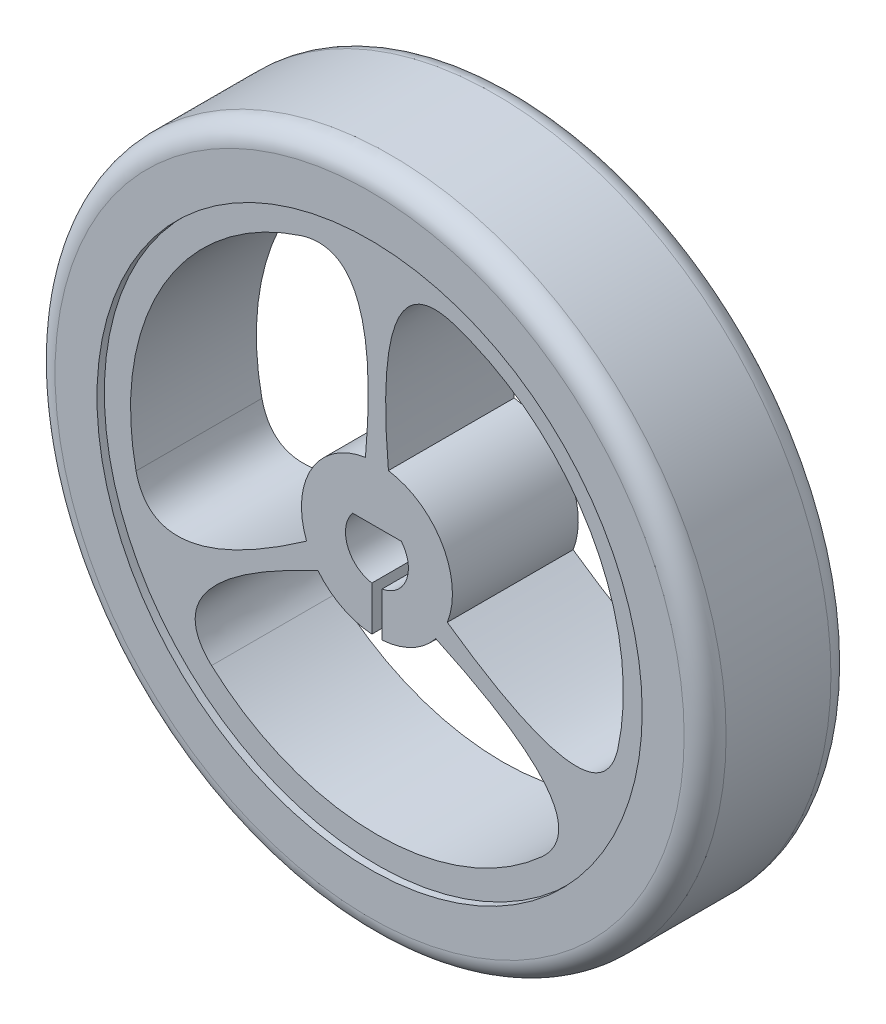
ISO-10303-21;
HEADER;
FILE_DESCRIPTION(('STEP AP214'),'2;1');
FILE_NAME('part.step','',(''),(''),'','','');
FILE_SCHEMA(('AUTOMOTIVE_DESIGN { 1 0 10303 214 1 1 1 1 }'));
ENDSEC;
DATA;
#1=APPLICATION_CONTEXT('core data for automotive mechanical design processes');
#2=APPLICATION_PROTOCOL_DEFINITION('international standard','automotive_design',2000,#1);
#3=PRODUCT_CONTEXT('',#1,'mechanical');
#4=PRODUCT('Part','Part','',(#3));
#5=PRODUCT_RELATED_PRODUCT_CATEGORY('part','',(#4));
#6=PRODUCT_DEFINITION_FORMATION('','',#4);
#7=PRODUCT_DEFINITION_CONTEXT('part definition',#1,'design');
#8=PRODUCT_DEFINITION('design','',#6,#7);
#9=PRODUCT_DEFINITION_SHAPE('','',#8);
#10=(LENGTH_UNIT() NAMED_UNIT(*) SI_UNIT(.MILLI.,.METRE.));
#11=(NAMED_UNIT(*) PLANE_ANGLE_UNIT() SI_UNIT($,.RADIAN.));
#12=(NAMED_UNIT(*) SI_UNIT($,.STERADIAN.) SOLID_ANGLE_UNIT());
#13=UNCERTAINTY_MEASURE_WITH_UNIT(LENGTH_MEASURE(1.E-05),#10,'distance_accuracy_value','');
#14=(GEOMETRIC_REPRESENTATION_CONTEXT(3) GLOBAL_UNCERTAINTY_ASSIGNED_CONTEXT((#13)) GLOBAL_UNIT_ASSIGNED_CONTEXT((#10,
#11,#12)) REPRESENTATION_CONTEXT('',''));
#15=CARTESIAN_POINT('',(0.,0.,0.));
#16=DIRECTION('',(0.,0.,1.));
#17=DIRECTION('',(1.,0.,0.));
#18=AXIS2_PLACEMENT_3D('',#15,#16,#17);
#19=CARTESIAN_POINT('',(0.,0.,4.85));
#20=DIRECTION('',(0.,0.,-1.));
#21=DIRECTION('',(-1.,0.,0.));
#22=AXIS2_PLACEMENT_3D('',#19,#20,#21);
#23=CYLINDRICAL_SURFACE('',#22,13.);
#24=CARTESIAN_POINT('',(0.,0.,-1.5));
#25=DIRECTION('',(0.,0.,-1.));
#26=DIRECTION('',(-1.,0.,0.));
#27=AXIS2_PLACEMENT_3D('',#24,#25,#26);
#28=CIRCLE('',#27,13.);
#29=CARTESIAN_POINT('',(-13.,0.,-1.5));
#30=VERTEX_POINT('',#29);
#31=EDGE_CURVE('E444',#30,#30,#28,.F.);
#32=ORIENTED_EDGE('',*,*,#31,.T.);
#33=EDGE_LOOP('',(#32));
#34=FACE_BOUND('',#33,.T.);
#35=CARTESIAN_POINT('',(0.,0.,-2.15));
#36=DIRECTION('',(0.,0.,1.));
#37=DIRECTION('',(1.,0.,0.));
#38=AXIS2_PLACEMENT_3D('',#35,#36,#37);
#39=CIRCLE('',#38,13.);
#40=CARTESIAN_POINT('',(13.,0.,-2.15));
#41=VERTEX_POINT('',#40);
#42=EDGE_CURVE('E445',#41,#41,#39,.T.);
#43=ORIENTED_EDGE('',*,*,#42,.F.);
#44=EDGE_LOOP('',(#43));
#45=FACE_BOUND('',#44,.T.);
#46=ADVANCED_FACE('F123',(#34,#45),#23,.F.);
#47=CARTESIAN_POINT('',(0.,0.,4.85));
#48=DIRECTION('',(0.,0.,1.));
#49=DIRECTION('',(1.,0.,0.));
#50=AXIS2_PLACEMENT_3D('',#47,#48,#49);
#51=PLANE('',#50);
#52=CARTESIAN_POINT('',(0.,0.,4.85));
#53=DIRECTION('',(0.,0.,1.));
#54=DIRECTION('',(1.,0.,0.));
#55=AXIS2_PLACEMENT_3D('',#52,#53,#54);
#56=CIRCLE('',#55,15.);
#57=CARTESIAN_POINT('',(15.,0.,4.85));
#58=VERTEX_POINT('',#57);
#59=EDGE_CURVE('E529',#58,#58,#56,.T.);
#60=ORIENTED_EDGE('',*,*,#59,.T.);
#61=EDGE_LOOP('',(#60));
#62=FACE_BOUND('',#61,.T.);
#63=CARTESIAN_POINT('',(0.,0.,4.85));
#64=DIRECTION('',(0.,0.,1.));
#65=DIRECTION('',(1.,0.,0.));
#66=AXIS2_PLACEMENT_3D('',#63,#64,#65);
#67=CIRCLE('',#66,13.);
#68=CARTESIAN_POINT('',(13.,0.,4.85));
#69=VERTEX_POINT('',#68);
#70=EDGE_CURVE('E442',#69,#69,#67,.T.);
#71=ORIENTED_EDGE('',*,*,#70,.F.);
#72=EDGE_LOOP('',(#71));
#73=FACE_BOUND('',#72,.T.);
#74=ADVANCED_FACE('F414',(#62,#73),#51,.T.);
#75=CARTESIAN_POINT('',(0.,0.,4.85));
#76=DIRECTION('',(0.,0.,-1.));
#77=DIRECTION('',(-1.,0.,0.));
#78=AXIS2_PLACEMENT_3D('',#75,#76,#77);
#79=CYLINDRICAL_SURFACE('',#78,16.);
#80=CARTESIAN_POINT('',(0.,0.,-1.15));
#81=DIRECTION('',(0.,0.,1.));
#82=DIRECTION('',(1.,0.,0.));
#83=AXIS2_PLACEMENT_3D('',#80,#81,#82);
#84=CIRCLE('',#83,16.);
#85=CARTESIAN_POINT('',(16.,0.,-1.15));
#86=VERTEX_POINT('',#85);
#87=EDGE_CURVE('E131',#86,#86,#84,.T.);
#88=ORIENTED_EDGE('',*,*,#87,.T.);
#89=EDGE_LOOP('',(#88));
#90=FACE_BOUND('',#89,.T.);
#91=CARTESIAN_POINT('',(0.,0.,3.85));
#92=DIRECTION('',(0.,0.,1.));
#93=DIRECTION('',(1.,0.,0.));
#94=AXIS2_PLACEMENT_3D('',#91,#92,#93);
#95=CIRCLE('',#94,16.);
#96=CARTESIAN_POINT('',(16.,0.,3.85));
#97=VERTEX_POINT('',#96);
#98=EDGE_CURVE('E532',#97,#97,#95,.F.);
#99=ORIENTED_EDGE('',*,*,#98,.T.);
#100=EDGE_LOOP('',(#99));
#101=FACE_BOUND('',#100,.T.);
#102=ADVANCED_FACE('F421',(#90,#101),#79,.T.);
#103=CARTESIAN_POINT('',(0.,0.,4.5));
#104=DIRECTION('',(0.,0.,1.));
#105=DIRECTION('',(1.,0.,0.));
#106=AXIS2_PLACEMENT_3D('',#103,#104,#105);
#107=CIRCLE('',#106,13.);
#108=CARTESIAN_POINT('',(13.,0.,4.5));
#109=VERTEX_POINT('',#108);
#110=EDGE_CURVE('E268',#109,#109,#107,.F.);
#111=ORIENTED_EDGE('',*,*,#110,.T.);
#112=EDGE_LOOP('',(#111));
#113=FACE_BOUND('',#112,.T.);
#114=ORIENTED_EDGE('',*,*,#70,.T.);
#115=EDGE_LOOP('',(#114));
#116=FACE_BOUND('',#115,.T.);
#117=ADVANCED_FACE('F417',(#113,#116),#23,.F.);
#118=CARTESIAN_POINT('',(0.,0.,-2.15));
#119=DIRECTION('',(0.,0.,1.));
#120=DIRECTION('',(1.,0.,0.));
#121=AXIS2_PLACEMENT_3D('',#118,#119,#120);
#122=PLANE('',#121);
#123=CARTESIAN_POINT('',(0.,0.,-2.15));
#124=DIRECTION('',(0.,0.,1.));
#125=DIRECTION('',(1.,0.,0.));
#126=AXIS2_PLACEMENT_3D('',#123,#124,#125);
#127=CIRCLE('',#126,15.);
#128=CARTESIAN_POINT('',(15.,0.,-2.15));
#129=VERTEX_POINT('',#128);
#130=EDGE_CURVE('E12',#129,#129,#127,.F.);
#131=ORIENTED_EDGE('',*,*,#130,.T.);
#132=EDGE_LOOP('',(#131));
#133=FACE_BOUND('',#132,.T.);
#134=ORIENTED_EDGE('',*,*,#42,.T.);
#135=EDGE_LOOP('',(#134));
#136=FACE_BOUND('',#135,.T.);
#137=ADVANCED_FACE('F428',(#133,#136),#122,.F.);
#138=CARTESIAN_POINT('',(0.,0.,-2.5));
#139=DIRECTION('',(0.,0.,1.));
#140=DIRECTION('',(1.,0.,0.));
#141=AXIS2_PLACEMENT_3D('',#138,#139,#140);
#142=CYLINDRICAL_SURFACE('',#141,3.6);
#143=DIRECTION('',(0.,0.,1.));
#144=VECTOR('',#143,1.);
#145=CARTESIAN_POINT('',(-0.243283358234703,-3.59177020528959,-2.5));
#146=LINE('',#145,#144);
#147=CARTESIAN_POINT('',(-0.243283358234703,-3.59177020528959,4.5));
#148=VERTEX_POINT('',#147);
#149=CARTESIAN_POINT('',(-0.243283358234703,-3.59177020528959,-1.5));
#150=VERTEX_POINT('',#149);
#151=EDGE_CURVE('E522',#148,#150,#146,.F.);
#152=ORIENTED_EDGE('',*,*,#151,.F.);
#153=CARTESIAN_POINT('',(0.,0.,4.5));
#154=DIRECTION('',(0.,0.,1.));
#155=DIRECTION('',(1.,0.,0.));
#156=AXIS2_PLACEMENT_3D('',#153,#154,#155);
#157=CIRCLE('',#156,3.6);
#158=CARTESIAN_POINT('',(-2.8077726173713,-2.25308964072447,4.5));
#159=VERTEX_POINT('',#158);
#160=EDGE_CURVE('E146',#159,#148,#157,.T.);
#161=ORIENTED_EDGE('',*,*,#160,.F.);
#162=DIRECTION('',(0.,0.,1.));
#163=VECTOR('',#162,1.);
#164=CARTESIAN_POINT('',(-2.8077726173713,-2.25308964072447,-2.5));
#165=LINE('',#164,#163);
#166=CARTESIAN_POINT('',(-2.8077726173713,-2.25308964072447,-1.5));
#167=VERTEX_POINT('',#166);
#168=EDGE_CURVE('E566',#167,#159,#165,.T.);
#169=ORIENTED_EDGE('',*,*,#168,.F.);
#170=CARTESIAN_POINT('',(0.,0.,-1.5));
#171=DIRECTION('',(0.,0.,-1.));
#172=DIRECTION('',(-1.,0.,0.));
#173=AXIS2_PLACEMENT_3D('',#170,#171,#172);
#174=CIRCLE('',#173,3.6);
#175=EDGE_CURVE('E514',#150,#167,#174,.T.);
#176=ORIENTED_EDGE('',*,*,#175,.F.);
#177=EDGE_LOOP('',(#152,#161,#169,#176));
#178=FACE_BOUND('',#177,.T.);
#179=ADVANCED_FACE('F319',(#178),#142,.T.);
#180=CARTESIAN_POINT('',(0.,0.,4.5));
#181=DIRECTION('',(0.,0.,1.));
#182=DIRECTION('',(1.,0.,0.));
#183=AXIS2_PLACEMENT_3D('',#180,#181,#182);
#184=PLANE('',#183);
#185=DIRECTION('',(0.,-1.,0.));
#186=VECTOR('',#185,1.);
#187=CARTESIAN_POINT('',(-0.243283358234703,-3.59177020528959,4.5));
#188=LINE('',#187,#186);
#189=CARTESIAN_POINT('',(-0.243283358234703,-1.48013959058126,4.5));
#190=VERTEX_POINT('',#189);
#191=EDGE_CURVE('E260',#190,#148,#188,.T.);
#192=ORIENTED_EDGE('',*,*,#191,.F.);
#193=CARTESIAN_POINT('',(0.,0.,4.5));
#194=DIRECTION('',(0.,0.,1.));
#195=DIRECTION('',(1.,0.,0.));
#196=AXIS2_PLACEMENT_3D('',#193,#194,#195);
#197=CIRCLE('',#196,1.5);
#198=CARTESIAN_POINT('',(-1.16213688269537,0.948386981078451,4.5));
#199=VERTEX_POINT('',#198);
#200=EDGE_CURVE('E277',#199,#190,#197,.T.);
#201=ORIENTED_EDGE('',*,*,#200,.F.);
#202=DIRECTION('',(-1.,0.,0.));
#203=VECTOR('',#202,1.);
#204=CARTESIAN_POINT('',(-1.16213688269537,0.94838698107845,4.5));
#205=LINE('',#204,#203);
#206=CARTESIAN_POINT('',(1.16213688269537,0.94838698107845,4.5));
#207=VERTEX_POINT('',#206);
#208=EDGE_CURVE('E275',#207,#199,#205,.T.);
#209=ORIENTED_EDGE('',*,*,#208,.F.);
#210=CARTESIAN_POINT('',(0.,0.,4.5));
#211=DIRECTION('',(0.,0.,1.));
#212=DIRECTION('',(1.,0.,0.));
#213=AXIS2_PLACEMENT_3D('',#210,#211,#212);
#214=CIRCLE('',#213,1.5);
#215=CARTESIAN_POINT('',(0.246794300601734,-1.47955823582261,4.5));
#216=VERTEX_POINT('',#215);
#217=EDGE_CURVE('E255',#216,#207,#214,.T.);
#218=ORIENTED_EDGE('',*,*,#217,.F.);
#219=DIRECTION('',(0.,1.,0.));
#220=VECTOR('',#219,1.);
#221=CARTESIAN_POINT('',(0.246794300601735,-1.47955823582261,4.5));
#222=LINE('',#221,#220);
#223=CARTESIAN_POINT('',(0.246794300601735,-3.59153067273419,4.5));
#224=VERTEX_POINT('',#223);
#225=EDGE_CURVE('E263',#224,#216,#222,.T.);
#226=ORIENTED_EDGE('',*,*,#225,.F.);
#227=CARTESIAN_POINT('',(2.80777261737127,-2.25308964072451,4.5));
#228=VERTEX_POINT('',#227);
#229=EDGE_CURVE('E292',#224,#228,#157,.T.);
#230=ORIENTED_EDGE('',*,*,#229,.T.);
#231=CARTESIAN_POINT('',(2.80777261737127,-2.25308964072451,4.5));
#232=CARTESIAN_POINT('',(11.0278157301892,-6.07186206717597,4.5));
#233=CARTESIAN_POINT('',(7.7169011218461,-8.8606961958782,4.5));
#234=B_SPLINE_CURVE_WITH_KNOTS('',2,(#231,#232,#233),.UNSPECIFIED.,.F.,.F.,(3,3),(0.,1.),.UNSPECIFIED.);
#235=CARTESIAN_POINT('',(7.88642735997128,-8.71015289738915,4.5));
#236=VERTEX_POINT('',#235);
#237=EDGE_CURVE('E556',#228,#236,#234,.T.);
#238=ORIENTED_EDGE('',*,*,#237,.T.);
#239=CARTESIAN_POINT('',(0.,0.,4.5));
#240=DIRECTION('',(0.,0.,1.));
#241=DIRECTION('',(1.,0.,0.));
#242=AXIS2_PLACEMENT_3D('',#239,#240,#241);
#243=CIRCLE('',#242,11.75);
#244=CARTESIAN_POINT('',(-7.88642735997125,-8.71015289738917,4.5));
#245=VERTEX_POINT('',#244);
#246=EDGE_CURVE('E569',#245,#236,#243,.T.);
#247=ORIENTED_EDGE('',*,*,#246,.F.);
#248=CARTESIAN_POINT('',(-2.8077726173713,-2.25308964072447,4.5));
#249=CARTESIAN_POINT('',(-11.0278157301894,-6.07186206717588,4.5));
#250=CARTESIAN_POINT('',(-7.71690112184623,-8.86069619587809,4.5));
#251=B_SPLINE_CURVE_WITH_KNOTS('',2,(#248,#249,#250),.UNSPECIFIED.,.F.,.F.,(3,3),(0.,1.),.UNSPECIFIED.);
#252=EDGE_CURVE('E572',#159,#245,#251,.T.);
#253=ORIENTED_EDGE('',*,*,#252,.F.);
#254=ORIENTED_EDGE('',*,*,#160,.T.);
#255=EDGE_LOOP('',(#192,#201,#209,#218,#226,#230,#238,#247,#253,#254));
#256=FACE_BOUND('',#255,.T.);
#257=CARTESIAN_POINT('',(3.35511917455654,-1.30505759433179,4.5));
#258=CARTESIAN_POINT('',(10.7722946635441,-6.51443753700967,4.5));
#259=CARTESIAN_POINT('',(11.5320385617697,-2.25268431207237,4.5));
#260=B_SPLINE_CURVE_WITH_KNOTS('',2,(#257,#258,#259),.UNSPECIFIED.,.F.,.F.,(3,3),(0.,1.),.UNSPECIFIED.);
#261=CARTESIAN_POINT('',(3.35511917455654,-1.30505759433179,4.5));
#262=VERTEX_POINT('',#261);
#263=CARTESIAN_POINT('',(11.4864273599712,-2.47476999014158,4.5));
#264=VERTEX_POINT('',#263);
#265=EDGE_CURVE('E343',#262,#264,#260,.T.);
#266=ORIENTED_EDGE('',*,*,#265,.F.);
#267=CARTESIAN_POINT('',(0.,0.,4.5));
#268=DIRECTION('',(0.,0.,1.));
#269=DIRECTION('',(1.,0.,0.));
#270=AXIS2_PLACEMENT_3D('',#267,#268,#269);
#271=CIRCLE('',#270,3.6);
#272=CARTESIAN_POINT('',(0.547346557185329,3.5581472350561,4.5));
#273=VERTEX_POINT('',#272);
#274=EDGE_CURVE('E337',#262,#273,#271,.T.);
#275=ORIENTED_EDGE('',*,*,#274,.T.);
#276=CARTESIAN_POINT('',(0.547346557185512,3.55814723505607,4.5));
#277=CARTESIAN_POINT('',(-0.255521066645149,12.5862996041855,4.5));
#278=CARTESIAN_POINT('',(3.81513743992355,11.1133805079505,4.5));
#279=B_SPLINE_CURVE_WITH_KNOTS('',2,(#276,#277,#278),.UNSPECIFIED.,.F.,.F.,(3,3),(0.,1.),.UNSPECIFIED.);
#280=CARTESIAN_POINT('',(3.60000000000039,11.1849228875302,4.5));
#281=VERTEX_POINT('',#280);
#282=EDGE_CURVE('E355',#273,#281,#279,.T.);
#283=ORIENTED_EDGE('',*,*,#282,.T.);
#284=CARTESIAN_POINT('',(0.,0.,4.5));
#285=DIRECTION('',(0.,0.,1.));
#286=DIRECTION('',(1.,0.,0.));
#287=AXIS2_PLACEMENT_3D('',#284,#285,#286);
#288=CIRCLE('',#287,11.75);
#289=EDGE_CURVE('E349',#264,#281,#288,.T.);
#290=ORIENTED_EDGE('',*,*,#289,.F.);
#291=EDGE_LOOP('',(#266,#275,#283,#290));
#292=FACE_BOUND('',#291,.T.);
#293=ORIENTED_EDGE('',*,*,#110,.F.);
#294=EDGE_LOOP('',(#293));
#295=FACE_BOUND('',#294,.T.);
#296=CARTESIAN_POINT('',(-0.547346557185464,3.55814723505608,4.5));
#297=CARTESIAN_POINT('',(0.255521066645336,12.5862996041855,4.5));
#298=CARTESIAN_POINT('',(-3.8151374399234,11.1133805079505,4.5));
#299=B_SPLINE_CURVE_WITH_KNOTS('',2,(#296,#297,#298),.UNSPECIFIED.,.F.,.F.,(3,3),(0.,1.),.UNSPECIFIED.);
#300=CARTESIAN_POINT('',(-0.547346557185464,3.55814723505608,4.5));
#301=VERTEX_POINT('',#300);
#302=CARTESIAN_POINT('',(-3.60000000000043,11.1849228875302,4.5));
#303=VERTEX_POINT('',#302);
#304=EDGE_CURVE('E829',#301,#303,#299,.T.);
#305=ORIENTED_EDGE('',*,*,#304,.F.);
#306=CARTESIAN_POINT('',(0.,0.,4.5));
#307=DIRECTION('',(0.,0.,1.));
#308=DIRECTION('',(1.,0.,0.));
#309=AXIS2_PLACEMENT_3D('',#306,#307,#308);
#310=CIRCLE('',#309,3.6);
#311=CARTESIAN_POINT('',(-3.35511917455662,-1.30505759433157,4.5));
#312=VERTEX_POINT('',#311);
#313=EDGE_CURVE('E366',#301,#312,#310,.T.);
#314=ORIENTED_EDGE('',*,*,#313,.T.);
#315=CARTESIAN_POINT('',(-3.35511917455655,-1.30505759433174,4.5));
#316=CARTESIAN_POINT('',(-10.7722946635441,-6.51443753700951,4.5));
#317=CARTESIAN_POINT('',(-11.5320385617697,-2.25268431207221,4.5));
#318=B_SPLINE_CURVE_WITH_KNOTS('',2,(#315,#316,#317),.UNSPECIFIED.,.F.,.F.,(3,3),(0.,1.),.UNSPECIFIED.);
#319=CARTESIAN_POINT('',(-11.4864273599712,-2.47476999014161,4.5));
#320=VERTEX_POINT('',#319);
#321=EDGE_CURVE('E835',#312,#320,#318,.T.);
#322=ORIENTED_EDGE('',*,*,#321,.T.);
#323=CARTESIAN_POINT('',(0.,0.,4.5));
#324=DIRECTION('',(0.,0.,1.));
#325=DIRECTION('',(1.,0.,0.));
#326=AXIS2_PLACEMENT_3D('',#323,#324,#325);
#327=CIRCLE('',#326,11.75);
#328=EDGE_CURVE('E832',#303,#320,#327,.T.);
#329=ORIENTED_EDGE('',*,*,#328,.F.);
#330=EDGE_LOOP('',(#305,#314,#322,#329));
#331=FACE_BOUND('',#330,.T.);
#332=ADVANCED_FACE('F271',(#256,#292,#295,#331),#184,.T.);
#333=CARTESIAN_POINT('',(0.,0.,-1.5));
#334=DIRECTION('',(0.,0.,-1.));
#335=DIRECTION('',(-1.,0.,0.));
#336=AXIS2_PLACEMENT_3D('',#333,#334,#335);
#337=PLANE('',#336);
#338=DIRECTION('',(0.,1.,0.));
#339=VECTOR('',#338,1.);
#340=CARTESIAN_POINT('',(-0.243283358234703,0.,-1.5));
#341=LINE('',#340,#339);
#342=CARTESIAN_POINT('',(-0.243283358234703,-1.48013959058126,-1.5));
#343=VERTEX_POINT('',#342);
#344=EDGE_CURVE('E290',#150,#343,#341,.T.);
#345=ORIENTED_EDGE('',*,*,#344,.F.);
#346=ORIENTED_EDGE('',*,*,#175,.T.);
#347=CARTESIAN_POINT('',(-2.8077726173713,-2.25308964072447,-1.5));
#348=CARTESIAN_POINT('',(-11.0278157301894,-6.07186206717588,-1.5));
#349=CARTESIAN_POINT('',(-7.71690112184623,-8.86069619587809,-1.5));
#350=B_SPLINE_CURVE_WITH_KNOTS('',2,(#347,#348,#349),.UNSPECIFIED.,.F.,.F.,(3,3),(0.,1.),.UNSPECIFIED.);
#351=CARTESIAN_POINT('',(-7.88642735997125,-8.71015289738917,-1.5));
#352=VERTEX_POINT('',#351);
#353=EDGE_CURVE('E498',#352,#167,#350,.F.);
#354=ORIENTED_EDGE('',*,*,#353,.F.);
#355=CARTESIAN_POINT('',(0.,0.,-1.5));
#356=DIRECTION('',(0.,0.,-1.));
#357=DIRECTION('',(-1.,0.,0.));
#358=AXIS2_PLACEMENT_3D('',#355,#356,#357);
#359=CIRCLE('',#358,11.75);
#360=CARTESIAN_POINT('',(7.88642735997128,-8.71015289738915,-1.5));
#361=VERTEX_POINT('',#360);
#362=EDGE_CURVE('E503',#361,#352,#359,.T.);
#363=ORIENTED_EDGE('',*,*,#362,.F.);
#364=CARTESIAN_POINT('',(2.80777261737127,-2.25308964072451,-1.5));
#365=CARTESIAN_POINT('',(11.0278157301892,-6.07186206717597,-1.5));
#366=CARTESIAN_POINT('',(7.7169011218461,-8.8606961958782,-1.5));
#367=B_SPLINE_CURVE_WITH_KNOTS('',2,(#364,#365,#366),.UNSPECIFIED.,.F.,.F.,(3,3),(0.,1.),.UNSPECIFIED.);
#368=CARTESIAN_POINT('',(2.80777261737127,-2.25308964072451,-1.5));
#369=VERTEX_POINT('',#368);
#370=EDGE_CURVE('E509',#361,#369,#367,.F.);
#371=ORIENTED_EDGE('',*,*,#370,.T.);
#372=CARTESIAN_POINT('',(0.246794300601735,-3.59153067273419,-1.5));
#373=VERTEX_POINT('',#372);
#374=EDGE_CURVE('E515',#369,#373,#174,.T.);
#375=ORIENTED_EDGE('',*,*,#374,.T.);
#376=DIRECTION('',(0.,-1.,0.));
#377=VECTOR('',#376,1.);
#378=CARTESIAN_POINT('',(0.246794300601735,0.,-1.5));
#379=LINE('',#378,#377);
#380=CARTESIAN_POINT('',(0.246794300601734,-1.47955823582261,-1.5));
#381=VERTEX_POINT('',#380);
#382=EDGE_CURVE('E138',#381,#373,#379,.T.);
#383=ORIENTED_EDGE('',*,*,#382,.F.);
#384=CARTESIAN_POINT('',(0.,0.,-1.5));
#385=DIRECTION('',(0.,0.,-1.));
#386=DIRECTION('',(-1.,0.,0.));
#387=AXIS2_PLACEMENT_3D('',#384,#385,#386);
#388=CIRCLE('',#387,1.5);
#389=CARTESIAN_POINT('',(1.16213688269537,0.94838698107845,-1.5));
#390=VERTEX_POINT('',#389);
#391=EDGE_CURVE('E258',#390,#381,#388,.T.);
#392=ORIENTED_EDGE('',*,*,#391,.F.);
#393=DIRECTION('',(1.,0.,0.));
#394=VECTOR('',#393,1.);
#395=CARTESIAN_POINT('',(0.,0.94838698107845,-1.5));
#396=LINE('',#395,#394);
#397=CARTESIAN_POINT('',(-1.16213688269537,0.948386981078451,-1.5));
#398=VERTEX_POINT('',#397);
#399=EDGE_CURVE('E525',#398,#390,#396,.T.);
#400=ORIENTED_EDGE('',*,*,#399,.F.);
#401=CARTESIAN_POINT('',(0.,0.,-1.5));
#402=DIRECTION('',(0.,0.,-1.));
#403=DIRECTION('',(-1.,0.,0.));
#404=AXIS2_PLACEMENT_3D('',#401,#402,#403);
#405=CIRCLE('',#404,1.5);
#406=EDGE_CURVE('E527',#343,#398,#405,.T.);
#407=ORIENTED_EDGE('',*,*,#406,.F.);
#408=EDGE_LOOP('',(#345,#346,#354,#363,#371,#375,#383,#392,#400,#407));
#409=FACE_BOUND('',#408,.T.);
#410=CARTESIAN_POINT('',(0.547346557185512,3.55814723505607,-1.5));
#411=CARTESIAN_POINT('',(-0.255521066645149,12.5862996041855,-1.5));
#412=CARTESIAN_POINT('',(3.81513743992355,11.1133805079505,-1.5));
#413=B_SPLINE_CURVE_WITH_KNOTS('',2,(#410,#411,#412),.UNSPECIFIED.,.F.,.F.,(3,3),(0.,1.),.UNSPECIFIED.);
#414=CARTESIAN_POINT('',(3.60000000000039,11.1849228875302,-1.5));
#415=VERTEX_POINT('',#414);
#416=CARTESIAN_POINT('',(0.547346557185329,3.5581472350561,-1.5));
#417=VERTEX_POINT('',#416);
#418=EDGE_CURVE('E487',#415,#417,#413,.F.);
#419=ORIENTED_EDGE('',*,*,#418,.T.);
#420=CARTESIAN_POINT('',(0.,0.,-1.5));
#421=DIRECTION('',(0.,0.,-1.));
#422=DIRECTION('',(-1.,0.,0.));
#423=AXIS2_PLACEMENT_3D('',#420,#421,#422);
#424=CIRCLE('',#423,3.6);
#425=CARTESIAN_POINT('',(3.3551191745566,-1.30505759433162,-1.5));
#426=VERTEX_POINT('',#425);
#427=EDGE_CURVE('E492',#417,#426,#424,.T.);
#428=ORIENTED_EDGE('',*,*,#427,.T.);
#429=CARTESIAN_POINT('',(3.35511917455654,-1.30505759433179,-1.5));
#430=CARTESIAN_POINT('',(10.7722946635441,-6.51443753700967,-1.5));
#431=CARTESIAN_POINT('',(11.5320385617697,-2.25268431207237,-1.5));
#432=B_SPLINE_CURVE_WITH_KNOTS('',2,(#429,#430,#431),.UNSPECIFIED.,.F.,.F.,(3,3),(0.,1.),.UNSPECIFIED.);
#433=CARTESIAN_POINT('',(11.4864273599712,-2.47476999014158,-1.5));
#434=VERTEX_POINT('',#433);
#435=EDGE_CURVE('E467',#434,#426,#432,.F.);
#436=ORIENTED_EDGE('',*,*,#435,.F.);
#437=CARTESIAN_POINT('',(0.,0.,-1.5));
#438=DIRECTION('',(0.,0.,-1.));
#439=DIRECTION('',(-1.,0.,0.));
#440=AXIS2_PLACEMENT_3D('',#437,#438,#439);
#441=CIRCLE('',#440,11.75);
#442=EDGE_CURVE('E481',#415,#434,#441,.T.);
#443=ORIENTED_EDGE('',*,*,#442,.F.);
#444=EDGE_LOOP('',(#419,#428,#436,#443));
#445=FACE_BOUND('',#444,.T.);
#446=ORIENTED_EDGE('',*,*,#31,.F.);
#447=EDGE_LOOP('',(#446));
#448=FACE_BOUND('',#447,.T.);
#449=CARTESIAN_POINT('',(-3.35511917455655,-1.30505759433174,-1.5));
#450=CARTESIAN_POINT('',(-10.7722946635441,-6.51443753700951,-1.5));
#451=CARTESIAN_POINT('',(-11.5320385617697,-2.25268431207221,-1.5));
#452=B_SPLINE_CURVE_WITH_KNOTS('',2,(#449,#450,#451),.UNSPECIFIED.,.F.,.F.,(3,3),(0.,1.),.UNSPECIFIED.);
#453=CARTESIAN_POINT('',(-11.4864273599712,-2.47476999014161,-1.5));
#454=VERTEX_POINT('',#453);
#455=CARTESIAN_POINT('',(-3.35511917455662,-1.30505759433157,-1.5));
#456=VERTEX_POINT('',#455);
#457=EDGE_CURVE('E458',#454,#456,#452,.F.);
#458=ORIENTED_EDGE('',*,*,#457,.T.);
#459=CARTESIAN_POINT('',(0.,0.,-1.5));
#460=DIRECTION('',(0.,0.,-1.));
#461=DIRECTION('',(-1.,0.,0.));
#462=AXIS2_PLACEMENT_3D('',#459,#460,#461);
#463=CIRCLE('',#462,3.6);
#464=CARTESIAN_POINT('',(-0.54734655718528,3.55814723505611,-1.5));
#465=VERTEX_POINT('',#464);
#466=EDGE_CURVE('E460',#456,#465,#463,.T.);
#467=ORIENTED_EDGE('',*,*,#466,.T.);
#468=CARTESIAN_POINT('',(-0.547346557185464,3.55814723505608,-1.5));
#469=CARTESIAN_POINT('',(0.255521066645336,12.5862996041855,-1.5));
#470=CARTESIAN_POINT('',(-3.8151374399234,11.1133805079505,-1.5));
#471=B_SPLINE_CURVE_WITH_KNOTS('',2,(#468,#469,#470),.UNSPECIFIED.,.F.,.F.,(3,3),(0.,1.),.UNSPECIFIED.);
#472=CARTESIAN_POINT('',(-3.60000000000044,11.1849228875302,-1.5));
#473=VERTEX_POINT('',#472);
#474=EDGE_CURVE('E469',#473,#465,#471,.F.);
#475=ORIENTED_EDGE('',*,*,#474,.F.);
#476=CARTESIAN_POINT('',(0.,0.,-1.5));
#477=DIRECTION('',(0.,0.,-1.));
#478=DIRECTION('',(-1.,0.,0.));
#479=AXIS2_PLACEMENT_3D('',#476,#477,#478);
#480=CIRCLE('',#479,11.75);
#481=EDGE_CURVE('E462',#454,#473,#480,.T.);
#482=ORIENTED_EDGE('',*,*,#481,.F.);
#483=EDGE_LOOP('',(#458,#467,#475,#482));
#484=FACE_BOUND('',#483,.T.);
#485=ADVANCED_FACE('F396',(#409,#445,#448,#484),#337,.T.);
#486=CARTESIAN_POINT('',(0.,0.,-2.5));
#487=DIRECTION('',(0.,0.,1.));
#488=DIRECTION('',(1.,0.,0.));
#489=AXIS2_PLACEMENT_3D('',#486,#487,#488);
#490=CYLINDRICAL_SURFACE('',#489,3.6);
#491=DIRECTION('',(0.,0.,1.));
#492=VECTOR('',#491,1.);
#493=CARTESIAN_POINT('',(-3.35511917455662,-1.30505759433157,-2.5));
#494=LINE('',#493,#492);
#495=EDGE_CURVE('E847',#456,#312,#494,.T.);
#496=ORIENTED_EDGE('',*,*,#495,.T.);
#497=ORIENTED_EDGE('',*,*,#313,.F.);
#498=DIRECTION('',(0.,0.,1.));
#499=VECTOR('',#498,1.);
#500=CARTESIAN_POINT('',(-0.54734655718528,3.55814723505611,-2.5));
#501=LINE('',#500,#499);
#502=EDGE_CURVE('E846',#465,#301,#501,.T.);
#503=ORIENTED_EDGE('',*,*,#502,.F.);
#504=ORIENTED_EDGE('',*,*,#466,.F.);
#505=EDGE_LOOP('',(#496,#497,#503,#504));
#506=FACE_BOUND('',#505,.T.);
#507=ADVANCED_FACE('F392',(#506),#490,.T.);
#508=CARTESIAN_POINT('',(-3.35511917455655,-1.30505759433174,-2.5));
#509=CARTESIAN_POINT('',(-10.7722946635441,-6.51443753700951,-2.5));
#510=CARTESIAN_POINT('',(-11.5320385617697,-2.25268431207221,-2.5));
#511=B_SPLINE_CURVE_WITH_KNOTS('',2,(#508,#509,#510),.UNSPECIFIED.,.F.,.F.,(3,3),(0.,1.),.UNSPECIFIED.);
#512=DIRECTION('',(0.,0.,1.));
#513=VECTOR('',#512,1.);
#514=SURFACE_OF_LINEAR_EXTRUSION('',#511,#513);
#515=DIRECTION('',(0.,0.,1.));
#516=VECTOR('',#515,1.);
#517=CARTESIAN_POINT('',(-11.4864273599712,-2.47476999014161,-2.5));
#518=LINE('',#517,#516);
#519=EDGE_CURVE('E852',#454,#320,#518,.T.);
#520=ORIENTED_EDGE('',*,*,#519,.T.);
#521=ORIENTED_EDGE('',*,*,#321,.F.);
#522=ORIENTED_EDGE('',*,*,#495,.F.);
#523=ORIENTED_EDGE('',*,*,#457,.F.);
#524=EDGE_LOOP('',(#520,#521,#522,#523));
#525=FACE_BOUND('',#524,.T.);
#526=ADVANCED_FACE('F395',(#525),#514,.T.);
#527=CARTESIAN_POINT('',(0.,0.,-2.5));
#528=DIRECTION('',(0.,0.,1.));
#529=DIRECTION('',(1.,0.,0.));
#530=AXIS2_PLACEMENT_3D('',#527,#528,#529);
#531=CYLINDRICAL_SURFACE('',#530,11.75);
#532=ORIENTED_EDGE('',*,*,#481,.T.);
#533=DIRECTION('',(0.,0.,1.));
#534=VECTOR('',#533,1.);
#535=CARTESIAN_POINT('',(-3.60000000000043,11.1849228875302,-2.5));
#536=LINE('',#535,#534);
#537=EDGE_CURVE('E854',#473,#303,#536,.T.);
#538=ORIENTED_EDGE('',*,*,#537,.T.);
#539=ORIENTED_EDGE('',*,*,#328,.T.);
#540=ORIENTED_EDGE('',*,*,#519,.F.);
#541=EDGE_LOOP('',(#532,#538,#539,#540));
#542=FACE_BOUND('',#541,.T.);
#543=ADVANCED_FACE('F389',(#542),#531,.F.);
#544=CARTESIAN_POINT('',(-0.547346557185464,3.55814723505608,-2.5));
#545=CARTESIAN_POINT('',(0.255521066645336,12.5862996041855,-2.5));
#546=CARTESIAN_POINT('',(-3.8151374399234,11.1133805079505,-2.5));
#547=B_SPLINE_CURVE_WITH_KNOTS('',2,(#544,#545,#546),.UNSPECIFIED.,.F.,.F.,(3,3),(0.,1.),.UNSPECIFIED.);
#548=DIRECTION('',(0.,0.,1.));
#549=VECTOR('',#548,1.);
#550=SURFACE_OF_LINEAR_EXTRUSION('',#547,#549);
#551=ORIENTED_EDGE('',*,*,#474,.T.);
#552=ORIENTED_EDGE('',*,*,#502,.T.);
#553=ORIENTED_EDGE('',*,*,#304,.T.);
#554=ORIENTED_EDGE('',*,*,#537,.F.);
#555=EDGE_LOOP('',(#551,#552,#553,#554));
#556=FACE_BOUND('',#555,.T.);
#557=ADVANCED_FACE('F385',(#556),#550,.F.);
#558=CARTESIAN_POINT('',(0.,0.,-2.5));
#559=DIRECTION('',(0.,0.,1.));
#560=DIRECTION('',(1.,0.,0.));
#561=AXIS2_PLACEMENT_3D('',#558,#559,#560);
#562=CYLINDRICAL_SURFACE('',#561,3.6);
#563=DIRECTION('',(0.,0.,1.));
#564=VECTOR('',#563,1.);
#565=CARTESIAN_POINT('',(0.547346557185329,3.5581472350561,-2.5));
#566=LINE('',#565,#564);
#567=EDGE_CURVE('E361',#417,#273,#566,.T.);
#568=ORIENTED_EDGE('',*,*,#567,.T.);
#569=ORIENTED_EDGE('',*,*,#274,.F.);
#570=DIRECTION('',(0.,0.,1.));
#571=VECTOR('',#570,1.);
#572=CARTESIAN_POINT('',(3.3551191745566,-1.30505759433162,-2.5));
#573=LINE('',#572,#571);
#574=EDGE_CURVE('E360',#426,#262,#573,.T.);
#575=ORIENTED_EDGE('',*,*,#574,.F.);
#576=ORIENTED_EDGE('',*,*,#427,.F.);
#577=EDGE_LOOP('',(#568,#569,#575,#576));
#578=FACE_BOUND('',#577,.T.);
#579=ADVANCED_FACE('F325',(#578),#562,.T.);
#580=CARTESIAN_POINT('',(0.547346557185512,3.55814723505607,-2.5));
#581=CARTESIAN_POINT('',(-0.255521066645149,12.5862996041855,-2.5));
#582=CARTESIAN_POINT('',(3.81513743992355,11.1133805079505,-2.5));
#583=B_SPLINE_CURVE_WITH_KNOTS('',2,(#580,#581,#582),.UNSPECIFIED.,.F.,.F.,(3,3),(0.,1.),.UNSPECIFIED.);
#584=DIRECTION('',(0.,0.,1.));
#585=VECTOR('',#584,1.);
#586=SURFACE_OF_LINEAR_EXTRUSION('',#583,#585);
#587=DIRECTION('',(0.,0.,1.));
#588=VECTOR('',#587,1.);
#589=CARTESIAN_POINT('',(3.60000000000039,11.1849228875302,-2.5));
#590=LINE('',#589,#588);
#591=EDGE_CURVE('E367',#415,#281,#590,.T.);
#592=ORIENTED_EDGE('',*,*,#591,.T.);
#593=ORIENTED_EDGE('',*,*,#282,.F.);
#594=ORIENTED_EDGE('',*,*,#567,.F.);
#595=ORIENTED_EDGE('',*,*,#418,.F.);
#596=EDGE_LOOP('',(#592,#593,#594,#595));
#597=FACE_BOUND('',#596,.T.);
#598=ADVANCED_FACE('F320',(#597),#586,.T.);
#599=CARTESIAN_POINT('',(0.,0.,-2.5));
#600=DIRECTION('',(0.,0.,1.));
#601=DIRECTION('',(1.,0.,0.));
#602=AXIS2_PLACEMENT_3D('',#599,#600,#601);
#603=CYLINDRICAL_SURFACE('',#602,11.75);
#604=ORIENTED_EDGE('',*,*,#442,.T.);
#605=DIRECTION('',(0.,0.,1.));
#606=VECTOR('',#605,1.);
#607=CARTESIAN_POINT('',(11.4864273599712,-2.47476999014158,-2.5));
#608=LINE('',#607,#606);
#609=EDGE_CURVE('E369',#434,#264,#608,.T.);
#610=ORIENTED_EDGE('',*,*,#609,.T.);
#611=ORIENTED_EDGE('',*,*,#289,.T.);
#612=ORIENTED_EDGE('',*,*,#591,.F.);
#613=EDGE_LOOP('',(#604,#610,#611,#612));
#614=FACE_BOUND('',#613,.T.);
#615=ADVANCED_FACE('F324',(#614),#603,.F.);
#616=CARTESIAN_POINT('',(3.35511917455654,-1.30505759433179,-2.5));
#617=CARTESIAN_POINT('',(10.7722946635441,-6.51443753700967,-2.5));
#618=CARTESIAN_POINT('',(11.5320385617697,-2.25268431207237,-2.5));
#619=B_SPLINE_CURVE_WITH_KNOTS('',2,(#616,#617,#618),.UNSPECIFIED.,.F.,.F.,(3,3),(0.,1.),.UNSPECIFIED.);
#620=DIRECTION('',(0.,0.,1.));
#621=VECTOR('',#620,1.);
#622=SURFACE_OF_LINEAR_EXTRUSION('',#619,#621);
#623=ORIENTED_EDGE('',*,*,#435,.T.);
#624=ORIENTED_EDGE('',*,*,#574,.T.);
#625=ORIENTED_EDGE('',*,*,#265,.T.);
#626=ORIENTED_EDGE('',*,*,#609,.F.);
#627=EDGE_LOOP('',(#623,#624,#625,#626));
#628=FACE_BOUND('',#627,.T.);
#629=ADVANCED_FACE('F317',(#628),#622,.F.);
#630=DIRECTION('',(0.,0.,1.));
#631=VECTOR('',#630,1.);
#632=CARTESIAN_POINT('',(0.246794300601735,-3.59153067273419,-2.5));
#633=LINE('',#632,#631);
#634=EDGE_CURVE('E265',#373,#224,#633,.T.);
#635=ORIENTED_EDGE('',*,*,#634,.F.);
#636=ORIENTED_EDGE('',*,*,#374,.F.);
#637=DIRECTION('',(0.,0.,1.));
#638=VECTOR('',#637,1.);
#639=CARTESIAN_POINT('',(2.80777261737127,-2.25308964072451,-2.5));
#640=LINE('',#639,#638);
#641=EDGE_CURVE('E344',#369,#228,#640,.T.);
#642=ORIENTED_EDGE('',*,*,#641,.T.);
#643=ORIENTED_EDGE('',*,*,#229,.F.);
#644=EDGE_LOOP('',(#635,#636,#642,#643));
#645=FACE_BOUND('',#644,.T.);
#646=ADVANCED_FACE('F313',(#645),#142,.T.);
#647=CARTESIAN_POINT('',(2.80777261737127,-2.25308964072451,-2.5));
#648=CARTESIAN_POINT('',(11.0278157301892,-6.07186206717597,-2.5));
#649=CARTESIAN_POINT('',(7.7169011218461,-8.8606961958782,-2.5));
#650=B_SPLINE_CURVE_WITH_KNOTS('',2,(#647,#648,#649),.UNSPECIFIED.,.F.,.F.,(3,3),(0.,1.),.UNSPECIFIED.);
#651=DIRECTION('',(0.,0.,1.));
#652=VECTOR('',#651,1.);
#653=SURFACE_OF_LINEAR_EXTRUSION('',#650,#652);
#654=DIRECTION('',(0.,0.,1.));
#655=VECTOR('',#654,1.);
#656=CARTESIAN_POINT('',(7.88642735997128,-8.71015289738915,-2.5));
#657=LINE('',#656,#655);
#658=EDGE_CURVE('E557',#361,#236,#657,.T.);
#659=ORIENTED_EDGE('',*,*,#658,.T.);
#660=ORIENTED_EDGE('',*,*,#237,.F.);
#661=ORIENTED_EDGE('',*,*,#641,.F.);
#662=ORIENTED_EDGE('',*,*,#370,.F.);
#663=EDGE_LOOP('',(#659,#660,#661,#662));
#664=FACE_BOUND('',#663,.T.);
#665=ADVANCED_FACE('F316',(#664),#653,.T.);
#666=CARTESIAN_POINT('',(0.,0.,-2.5));
#667=DIRECTION('',(0.,0.,1.));
#668=DIRECTION('',(1.,0.,0.));
#669=AXIS2_PLACEMENT_3D('',#666,#667,#668);
#670=CYLINDRICAL_SURFACE('',#669,11.75);
#671=ORIENTED_EDGE('',*,*,#362,.T.);
#672=DIRECTION('',(0.,0.,1.));
#673=VECTOR('',#672,1.);
#674=CARTESIAN_POINT('',(-7.88642735997125,-8.71015289738917,-2.5));
#675=LINE('',#674,#673);
#676=EDGE_CURVE('E559',#352,#245,#675,.T.);
#677=ORIENTED_EDGE('',*,*,#676,.T.);
#678=ORIENTED_EDGE('',*,*,#246,.T.);
#679=ORIENTED_EDGE('',*,*,#658,.F.);
#680=EDGE_LOOP('',(#671,#677,#678,#679));
#681=FACE_BOUND('',#680,.T.);
#682=ADVANCED_FACE('F310',(#681),#670,.F.);
#683=CARTESIAN_POINT('',(-2.8077726173713,-2.25308964072447,-2.5));
#684=CARTESIAN_POINT('',(-11.0278157301894,-6.07186206717588,-2.5));
#685=CARTESIAN_POINT('',(-7.71690112184623,-8.86069619587809,-2.5));
#686=B_SPLINE_CURVE_WITH_KNOTS('',2,(#683,#684,#685),.UNSPECIFIED.,.F.,.F.,(3,3),(0.,1.),.UNSPECIFIED.);
#687=DIRECTION('',(0.,0.,1.));
#688=VECTOR('',#687,1.);
#689=SURFACE_OF_LINEAR_EXTRUSION('',#686,#688);
#690=ORIENTED_EDGE('',*,*,#353,.T.);
#691=ORIENTED_EDGE('',*,*,#168,.T.);
#692=ORIENTED_EDGE('',*,*,#252,.T.);
#693=ORIENTED_EDGE('',*,*,#676,.F.);
#694=EDGE_LOOP('',(#690,#691,#692,#693));
#695=FACE_BOUND('',#694,.T.);
#696=ADVANCED_FACE('F305',(#695),#689,.F.);
#697=CARTESIAN_POINT('',(-0.243283358234703,-3.59177020528959,-2.5));
#698=DIRECTION('',(-1.,0.,0.));
#699=DIRECTION('',(0.,0.,1.));
#700=AXIS2_PLACEMENT_3D('',#697,#698,#699);
#701=PLANE('',#700);
#702=ORIENTED_EDGE('',*,*,#344,.T.);
#703=DIRECTION('',(0.,0.,1.));
#704=VECTOR('',#703,1.);
#705=CARTESIAN_POINT('',(-0.243283358234703,-1.48013959058126,-2.5));
#706=LINE('',#705,#704);
#707=EDGE_CURVE('E284',#343,#190,#706,.T.);
#708=ORIENTED_EDGE('',*,*,#707,.T.);
#709=ORIENTED_EDGE('',*,*,#191,.T.);
#710=ORIENTED_EDGE('',*,*,#151,.T.);
#711=EDGE_LOOP('',(#702,#708,#709,#710));
#712=FACE_BOUND('',#711,.T.);
#713=ADVANCED_FACE('F309',(#712),#701,.F.);
#714=CARTESIAN_POINT('',(0.,0.,-2.5));
#715=DIRECTION('',(0.,0.,1.));
#716=DIRECTION('',(1.,0.,0.));
#717=AXIS2_PLACEMENT_3D('',#714,#715,#716);
#718=CYLINDRICAL_SURFACE('',#717,1.5);
#719=ORIENTED_EDGE('',*,*,#406,.T.);
#720=DIRECTION('',(0.,0.,1.));
#721=VECTOR('',#720,1.);
#722=CARTESIAN_POINT('',(-1.16213688269537,0.948386981078451,-2.5));
#723=LINE('',#722,#721);
#724=EDGE_CURVE('E286',#398,#199,#723,.T.);
#725=ORIENTED_EDGE('',*,*,#724,.T.);
#726=ORIENTED_EDGE('',*,*,#200,.T.);
#727=ORIENTED_EDGE('',*,*,#707,.F.);
#728=EDGE_LOOP('',(#719,#725,#726,#727));
#729=FACE_BOUND('',#728,.T.);
#730=ADVANCED_FACE('F543',(#729),#718,.F.);
#731=CARTESIAN_POINT('',(-1.16213688269537,0.94838698107845,-2.5));
#732=DIRECTION('',(0.,1.,0.));
#733=DIRECTION('',(0.,0.,1.));
#734=AXIS2_PLACEMENT_3D('',#731,#732,#733);
#735=PLANE('',#734);
#736=ORIENTED_EDGE('',*,*,#399,.T.);
#737=DIRECTION('',(0.,0.,1.));
#738=VECTOR('',#737,1.);
#739=CARTESIAN_POINT('',(1.16213688269537,0.94838698107845,-2.5));
#740=LINE('',#739,#738);
#741=EDGE_CURVE('E259',#390,#207,#740,.T.);
#742=ORIENTED_EDGE('',*,*,#741,.T.);
#743=ORIENTED_EDGE('',*,*,#208,.T.);
#744=ORIENTED_EDGE('',*,*,#724,.F.);
#745=EDGE_LOOP('',(#736,#742,#743,#744));
#746=FACE_BOUND('',#745,.T.);
#747=ADVANCED_FACE('F547',(#746),#735,.F.);
#748=CARTESIAN_POINT('',(0.,0.,-2.5));
#749=DIRECTION('',(0.,0.,1.));
#750=DIRECTION('',(1.,0.,0.));
#751=AXIS2_PLACEMENT_3D('',#748,#749,#750);
#752=CYLINDRICAL_SURFACE('',#751,1.5);
#753=ORIENTED_EDGE('',*,*,#391,.T.);
#754=DIRECTION('',(0.,0.,1.));
#755=VECTOR('',#754,1.);
#756=CARTESIAN_POINT('',(0.246794300601734,-1.47955823582261,-2.5));
#757=LINE('',#756,#755);
#758=EDGE_CURVE('E250',#381,#216,#757,.T.);
#759=ORIENTED_EDGE('',*,*,#758,.T.);
#760=ORIENTED_EDGE('',*,*,#217,.T.);
#761=ORIENTED_EDGE('',*,*,#741,.F.);
#762=EDGE_LOOP('',(#753,#759,#760,#761));
#763=FACE_BOUND('',#762,.T.);
#764=ADVANCED_FACE('F252',(#763),#752,.F.);
#765=CARTESIAN_POINT('',(0.246794300601735,-1.47955823582261,-2.5));
#766=DIRECTION('',(1.,0.,0.));
#767=DIRECTION('',(0.,0.,-1.));
#768=AXIS2_PLACEMENT_3D('',#765,#766,#767);
#769=PLANE('',#768);
#770=ORIENTED_EDGE('',*,*,#382,.T.);
#771=ORIENTED_EDGE('',*,*,#634,.T.);
#772=ORIENTED_EDGE('',*,*,#225,.T.);
#773=ORIENTED_EDGE('',*,*,#758,.F.);
#774=EDGE_LOOP('',(#770,#771,#772,#773));
#775=FACE_BOUND('',#774,.T.);
#776=ADVANCED_FACE('F264',(#775),#769,.F.);
#777=CARTESIAN_POINT('',(0.,0.,3.85));
#778=DIRECTION('',(0.,0.,1.));
#779=DIRECTION('',(1.,0.,0.));
#780=AXIS2_PLACEMENT_3D('',#777,#778,#779);
#781=TOROIDAL_SURFACE('',#780,15.,1.);
#782=ORIENTED_EDGE('',*,*,#98,.F.);
#783=EDGE_LOOP('',(#782));
#784=FACE_BOUND('',#783,.T.);
#785=ORIENTED_EDGE('',*,*,#59,.F.);
#786=EDGE_LOOP('',(#785));
#787=FACE_BOUND('',#786,.T.);
#788=ADVANCED_FACE('F402',(#784,#787),#781,.T.);
#789=CARTESIAN_POINT('',(0.,0.,-1.15));
#790=DIRECTION('',(0.,0.,1.));
#791=DIRECTION('',(1.,0.,0.));
#792=AXIS2_PLACEMENT_3D('',#789,#790,#791);
#793=TOROIDAL_SURFACE('',#792,15.,1.);
#794=ORIENTED_EDGE('',*,*,#130,.F.);
#795=EDGE_LOOP('',(#794));
#796=FACE_BOUND('',#795,.T.);
#797=ORIENTED_EDGE('',*,*,#87,.F.);
#798=EDGE_LOOP('',(#797));
#799=FACE_BOUND('',#798,.T.);
#800=ADVANCED_FACE('F125',(#796,#799),#793,.T.);
#801=CLOSED_SHELL('',(#46,#74,#102,#117,#137,#179,#332,#485,#507,#526,#543,#557,#579,#598,#615,
#629,#646,#665,#682,#696,#713,#730,#747,#764,#776,#788,#800));
#802=MANIFOLD_SOLID_BREP('B2',#801);
#803=ADVANCED_BREP_SHAPE_REPRESENTATION('',(#18,#802),#14);
#804=SHAPE_DEFINITION_REPRESENTATION(#9,#803);
ENDSEC;
END-ISO-10303-21;
